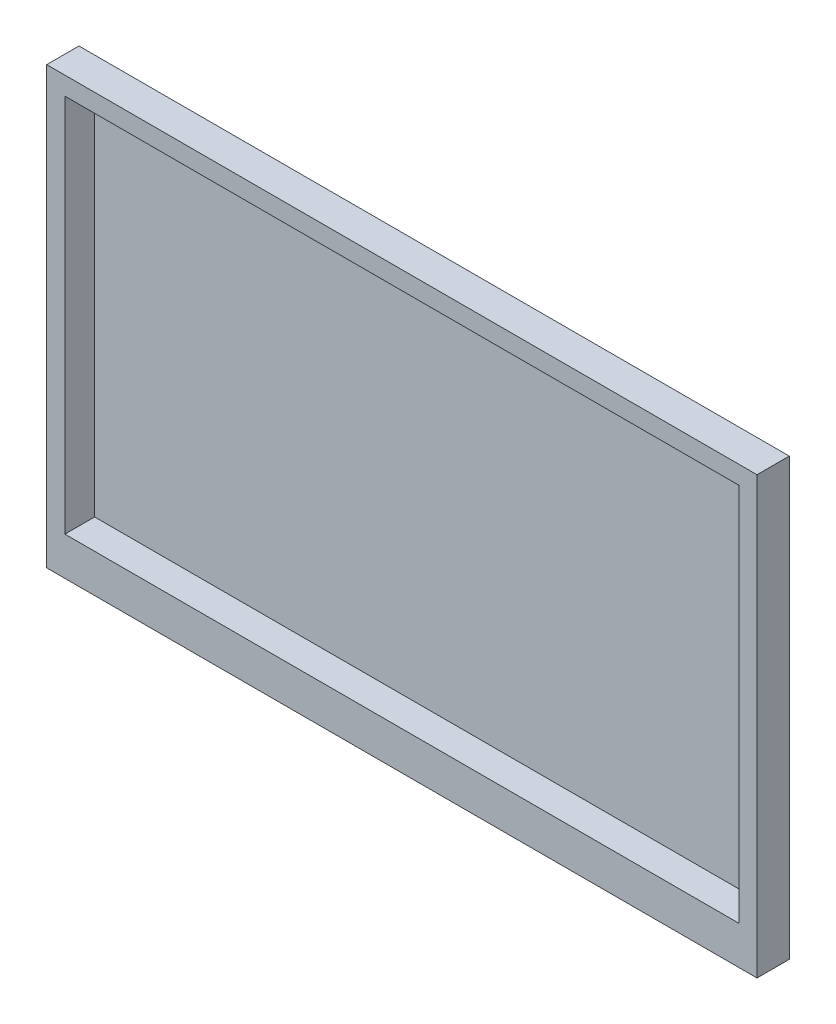
ISO-10303-21;
HEADER;
FILE_DESCRIPTION(('STEP AP214'),'2;1');
FILE_NAME('part.step','',(''),(''),'','','');
FILE_SCHEMA(('AUTOMOTIVE_DESIGN { 1 0 10303 214 1 1 1 1 }'));
ENDSEC;
DATA;
#1=APPLICATION_CONTEXT('core data for automotive mechanical design processes');
#2=APPLICATION_PROTOCOL_DEFINITION('international standard','automotive_design',2000,#1);
#3=PRODUCT_CONTEXT('',#1,'mechanical');
#4=PRODUCT('Part','Part','',(#3));
#5=PRODUCT_RELATED_PRODUCT_CATEGORY('part','',(#4));
#6=PRODUCT_DEFINITION_FORMATION('','',#4);
#7=PRODUCT_DEFINITION_CONTEXT('part definition',#1,'design');
#8=PRODUCT_DEFINITION('design','',#6,#7);
#9=PRODUCT_DEFINITION_SHAPE('','',#8);
#10=(LENGTH_UNIT() NAMED_UNIT(*) SI_UNIT(.MILLI.,.METRE.));
#11=(NAMED_UNIT(*) PLANE_ANGLE_UNIT() SI_UNIT($,.RADIAN.));
#12=(NAMED_UNIT(*) SI_UNIT($,.STERADIAN.) SOLID_ANGLE_UNIT());
#13=UNCERTAINTY_MEASURE_WITH_UNIT(LENGTH_MEASURE(1.E-05),#10,'distance_accuracy_value','');
#14=(GEOMETRIC_REPRESENTATION_CONTEXT(3) GLOBAL_UNCERTAINTY_ASSIGNED_CONTEXT((#13)) GLOBAL_UNIT_ASSIGNED_CONTEXT((#10,
#11,#12)) REPRESENTATION_CONTEXT('',''));
#15=CARTESIAN_POINT('',(0.,0.,0.));
#16=DIRECTION('',(0.,0.,1.));
#17=DIRECTION('',(1.,0.,0.));
#18=AXIS2_PLACEMENT_3D('',#15,#16,#17);
#19=CARTESIAN_POINT('',(279.4,-171.45,-25.4));
#20=DIRECTION('',(1.,0.,0.));
#21=DIRECTION('',(0.,0.,-1.));
#22=AXIS2_PLACEMENT_3D('',#19,#20,#21);
#23=PLANE('',#22);
#24=DIRECTION('',(0.,1.,0.));
#25=VECTOR('',#24,1.);
#26=CARTESIAN_POINT('',(279.4,-171.45,0.));
#27=LINE('',#26,#25);
#28=CARTESIAN_POINT('',(279.4,-171.45,0.));
#29=VERTEX_POINT('',#28);
#30=CARTESIAN_POINT('',(279.4,171.45,0.));
#31=VERTEX_POINT('',#30);
#32=EDGE_CURVE('E175',#29,#31,#27,.T.);
#33=ORIENTED_EDGE('',*,*,#32,.F.);
#34=DIRECTION('',(0.,0.,1.));
#35=VECTOR('',#34,1.);
#36=CARTESIAN_POINT('',(279.4,-171.45,-25.4));
#37=LINE('',#36,#35);
#38=CARTESIAN_POINT('',(279.4,-171.45,-25.4));
#39=VERTEX_POINT('',#38);
#40=EDGE_CURVE('E11',#39,#29,#37,.T.);
#41=ORIENTED_EDGE('',*,*,#40,.F.);
#42=DIRECTION('',(0.,1.,0.));
#43=VECTOR('',#42,1.);
#44=CARTESIAN_POINT('',(279.4,-171.45,-25.4));
#45=LINE('',#44,#43);
#46=CARTESIAN_POINT('',(279.4,171.45,-25.4));
#47=VERTEX_POINT('',#46);
#48=EDGE_CURVE('E181',#39,#47,#45,.T.);
#49=ORIENTED_EDGE('',*,*,#48,.T.);
#50=DIRECTION('',(0.,0.,1.));
#51=VECTOR('',#50,1.);
#52=CARTESIAN_POINT('',(279.4,171.45,-25.4));
#53=LINE('',#52,#51);
#54=EDGE_CURVE('E37',#47,#31,#53,.T.);
#55=ORIENTED_EDGE('',*,*,#54,.T.);
#56=EDGE_LOOP('',(#33,#41,#49,#55));
#57=FACE_BOUND('',#56,.T.);
#58=ADVANCED_FACE('F34',(#57),#23,.T.);
#59=CARTESIAN_POINT('',(-279.4,-171.45,-25.4));
#60=DIRECTION('',(0.,-1.,0.));
#61=DIRECTION('',(0.,0.,-1.));
#62=AXIS2_PLACEMENT_3D('',#59,#60,#61);
#63=PLANE('',#62);
#64=DIRECTION('',(1.,0.,0.));
#65=VECTOR('',#64,1.);
#66=CARTESIAN_POINT('',(-279.4,-171.45,0.));
#67=LINE('',#66,#65);
#68=CARTESIAN_POINT('',(-279.4,-171.45,0.));
#69=VERTEX_POINT('',#68);
#70=EDGE_CURVE('E185',#69,#29,#67,.T.);
#71=ORIENTED_EDGE('',*,*,#70,.F.);
#72=DIRECTION('',(0.,0.,1.));
#73=VECTOR('',#72,1.);
#74=CARTESIAN_POINT('',(-279.4,-171.45,-25.4));
#75=LINE('',#74,#73);
#76=CARTESIAN_POINT('',(-279.4,-171.45,-25.4));
#77=VERTEX_POINT('',#76);
#78=EDGE_CURVE('E42',#77,#69,#75,.T.);
#79=ORIENTED_EDGE('',*,*,#78,.F.);
#80=DIRECTION('',(1.,0.,0.));
#81=VECTOR('',#80,1.);
#82=CARTESIAN_POINT('',(-279.4,-171.45,-25.4));
#83=LINE('',#82,#81);
#84=EDGE_CURVE('E191',#77,#39,#83,.T.);
#85=ORIENTED_EDGE('',*,*,#84,.T.);
#86=ORIENTED_EDGE('',*,*,#40,.T.);
#87=EDGE_LOOP('',(#71,#79,#85,#86));
#88=FACE_BOUND('',#87,.T.);
#89=ADVANCED_FACE('F217',(#88),#63,.T.);
#90=CARTESIAN_POINT('',(-279.4,-171.45,-25.4));
#91=DIRECTION('',(-1.,0.,0.));
#92=DIRECTION('',(0.,0.,1.));
#93=AXIS2_PLACEMENT_3D('',#90,#91,#92);
#94=PLANE('',#93);
#95=DIRECTION('',(0.,-1.,0.));
#96=VECTOR('',#95,1.);
#97=CARTESIAN_POINT('',(-279.4,-171.45,0.));
#98=LINE('',#97,#96);
#99=CARTESIAN_POINT('',(-279.4,171.45,0.));
#100=VERTEX_POINT('',#99);
#101=EDGE_CURVE('E199',#100,#69,#98,.T.);
#102=ORIENTED_EDGE('',*,*,#101,.F.);
#103=DIRECTION('',(0.,0.,1.));
#104=VECTOR('',#103,1.);
#105=CARTESIAN_POINT('',(-279.4,171.45,-25.4));
#106=LINE('',#105,#104);
#107=CARTESIAN_POINT('',(-279.4,171.45,-25.4));
#108=VERTEX_POINT('',#107);
#109=EDGE_CURVE('E204',#108,#100,#106,.T.);
#110=ORIENTED_EDGE('',*,*,#109,.F.);
#111=DIRECTION('',(0.,-1.,0.));
#112=VECTOR('',#111,1.);
#113=CARTESIAN_POINT('',(-279.4,-171.45,-25.4));
#114=LINE('',#113,#112);
#115=EDGE_CURVE('E188',#108,#77,#114,.T.);
#116=ORIENTED_EDGE('',*,*,#115,.T.);
#117=ORIENTED_EDGE('',*,*,#78,.T.);
#118=EDGE_LOOP('',(#102,#110,#116,#117));
#119=FACE_BOUND('',#118,.T.);
#120=ADVANCED_FACE('F223',(#119),#94,.T.);
#121=CARTESIAN_POINT('',(-279.4,171.45,-25.4));
#122=DIRECTION('',(0.,1.,0.));
#123=DIRECTION('',(0.,0.,1.));
#124=AXIS2_PLACEMENT_3D('',#121,#122,#123);
#125=PLANE('',#124);
#126=DIRECTION('',(-1.,0.,0.));
#127=VECTOR('',#126,1.);
#128=CARTESIAN_POINT('',(-279.4,171.45,0.));
#129=LINE('',#128,#127);
#130=EDGE_CURVE('E196',#31,#100,#129,.T.);
#131=ORIENTED_EDGE('',*,*,#130,.F.);
#132=ORIENTED_EDGE('',*,*,#54,.F.);
#133=DIRECTION('',(-1.,0.,0.));
#134=VECTOR('',#133,1.);
#135=CARTESIAN_POINT('',(-279.4,171.45,-25.4));
#136=LINE('',#135,#134);
#137=EDGE_CURVE('E184',#47,#108,#136,.T.);
#138=ORIENTED_EDGE('',*,*,#137,.T.);
#139=ORIENTED_EDGE('',*,*,#109,.T.);
#140=EDGE_LOOP('',(#131,#132,#138,#139));
#141=FACE_BOUND('',#140,.T.);
#142=ADVANCED_FACE('F212',(#141),#125,.T.);
#143=CARTESIAN_POINT('',(0.,0.,-25.4));
#144=DIRECTION('',(0.,0.,-1.));
#145=DIRECTION('',(-1.,0.,0.));
#146=AXIS2_PLACEMENT_3D('',#143,#144,#145);
#147=PLANE('',#146);
#148=DIRECTION('',(0.,1.,0.));
#149=VECTOR('',#148,1.);
#150=CARTESIAN_POINT('',(-50.,-50.,-25.4));
#151=LINE('',#150,#149);
#152=CARTESIAN_POINT('',(-50.,-50.,-25.4));
#153=VERTEX_POINT('',#152);
#154=CARTESIAN_POINT('',(-50.,50.,-25.4));
#155=VERTEX_POINT('',#154);
#156=EDGE_CURVE('E50',#153,#155,#151,.T.);
#157=ORIENTED_EDGE('',*,*,#156,.F.);
#158=DIRECTION('',(-1.,0.,0.));
#159=VECTOR('',#158,1.);
#160=CARTESIAN_POINT('',(50.,-50.,-25.4));
#161=LINE('',#160,#159);
#162=CARTESIAN_POINT('',(50.,-50.,-25.4));
#163=VERTEX_POINT('',#162);
#164=EDGE_CURVE('E54',#163,#153,#161,.T.);
#165=ORIENTED_EDGE('',*,*,#164,.F.);
#166=DIRECTION('',(0.,-1.,0.));
#167=VECTOR('',#166,1.);
#168=CARTESIAN_POINT('',(50.,-50.,-25.4));
#169=LINE('',#168,#167);
#170=CARTESIAN_POINT('',(50.,50.,-25.4));
#171=VERTEX_POINT('',#170);
#172=EDGE_CURVE('E368',#171,#163,#169,.T.);
#173=ORIENTED_EDGE('',*,*,#172,.F.);
#174=DIRECTION('',(1.,0.,0.));
#175=VECTOR('',#174,1.);
#176=CARTESIAN_POINT('',(50.,50.,-25.4));
#177=LINE('',#176,#175);
#178=EDGE_CURVE('E374',#155,#171,#177,.T.);
#179=ORIENTED_EDGE('',*,*,#178,.F.);
#180=EDGE_LOOP('',(#157,#165,#173,#179));
#181=FACE_BOUND('',#180,.T.);
#182=ORIENTED_EDGE('',*,*,#48,.F.);
#183=ORIENTED_EDGE('',*,*,#84,.F.);
#184=ORIENTED_EDGE('',*,*,#115,.F.);
#185=ORIENTED_EDGE('',*,*,#137,.F.);
#186=EDGE_LOOP('',(#182,#183,#184,#185));
#187=FACE_BOUND('',#186,.T.);
#188=ADVANCED_FACE('F220',(#181,#187),#147,.T.);
#189=CARTESIAN_POINT('',(0.,0.,0.));
#190=DIRECTION('',(0.,0.,-1.));
#191=DIRECTION('',(-1.,0.,0.));
#192=AXIS2_PLACEMENT_3D('',#189,#190,#191);
#193=PLANE('',#192);
#194=DIRECTION('',(-1.,0.,0.));
#195=VECTOR('',#194,1.);
#196=CARTESIAN_POINT('',(-265.1125,157.1625,0.));
#197=LINE('',#196,#195);
#198=CARTESIAN_POINT('',(265.1125,157.1625,0.));
#199=VERTEX_POINT('',#198);
#200=CARTESIAN_POINT('',(-265.1125,157.1625,0.));
#201=VERTEX_POINT('',#200);
#202=EDGE_CURVE('E163',#199,#201,#197,.T.);
#203=ORIENTED_EDGE('',*,*,#202,.F.);
#204=DIRECTION('',(0.,1.,0.));
#205=VECTOR('',#204,1.);
#206=CARTESIAN_POINT('',(265.1125,-141.2875,0.));
#207=LINE('',#206,#205);
#208=CARTESIAN_POINT('',(265.1125,-141.2875,0.));
#209=VERTEX_POINT('',#208);
#210=EDGE_CURVE('E160',#209,#199,#207,.T.);
#211=ORIENTED_EDGE('',*,*,#210,.F.);
#212=DIRECTION('',(1.,0.,0.));
#213=VECTOR('',#212,1.);
#214=CARTESIAN_POINT('',(-265.1125,-141.2875,0.));
#215=LINE('',#214,#213);
#216=CARTESIAN_POINT('',(-265.1125,-141.2875,0.));
#217=VERTEX_POINT('',#216);
#218=EDGE_CURVE('E169',#217,#209,#215,.T.);
#219=ORIENTED_EDGE('',*,*,#218,.F.);
#220=DIRECTION('',(0.,-1.,0.));
#221=VECTOR('',#220,1.);
#222=CARTESIAN_POINT('',(-265.1125,-141.2875,0.));
#223=LINE('',#222,#221);
#224=EDGE_CURVE('E166',#201,#217,#223,.T.);
#225=ORIENTED_EDGE('',*,*,#224,.F.);
#226=EDGE_LOOP('',(#203,#211,#219,#225));
#227=FACE_BOUND('',#226,.T.);
#228=ORIENTED_EDGE('',*,*,#32,.T.);
#229=ORIENTED_EDGE('',*,*,#130,.T.);
#230=ORIENTED_EDGE('',*,*,#101,.T.);
#231=ORIENTED_EDGE('',*,*,#70,.T.);
#232=EDGE_LOOP('',(#228,#229,#230,#231));
#233=FACE_BOUND('',#232,.T.);
#234=ADVANCED_FACE('F214',(#227,#233),#193,.F.);
#235=CARTESIAN_POINT('',(265.1125,-141.2875,-25.4));
#236=DIRECTION('',(1.,0.,0.));
#237=DIRECTION('',(0.,0.,-1.));
#238=AXIS2_PLACEMENT_3D('',#235,#236,#237);
#239=PLANE('',#238);
#240=DIRECTION('',(0.,0.,1.));
#241=VECTOR('',#240,1.);
#242=CARTESIAN_POINT('',(265.1125,157.1625,-25.4));
#243=LINE('',#242,#241);
#244=CARTESIAN_POINT('',(265.1125,157.1625,-23.4));
#245=VERTEX_POINT('',#244);
#246=EDGE_CURVE('E172',#245,#199,#243,.T.);
#247=ORIENTED_EDGE('',*,*,#246,.F.);
#248=DIRECTION('',(0.,-1.,0.));
#249=VECTOR('',#248,1.);
#250=CARTESIAN_POINT('',(265.1125,-141.2875,-23.4));
#251=LINE('',#250,#249);
#252=CARTESIAN_POINT('',(265.1125,-141.2875,-23.4));
#253=VERTEX_POINT('',#252);
#254=EDGE_CURVE('E154',#245,#253,#251,.T.);
#255=ORIENTED_EDGE('',*,*,#254,.T.);
#256=DIRECTION('',(0.,0.,1.));
#257=VECTOR('',#256,1.);
#258=CARTESIAN_POINT('',(265.1125,-141.2875,-25.4));
#259=LINE('',#258,#257);
#260=EDGE_CURVE('E173',#253,#209,#259,.T.);
#261=ORIENTED_EDGE('',*,*,#260,.T.);
#262=ORIENTED_EDGE('',*,*,#210,.T.);
#263=EDGE_LOOP('',(#247,#255,#261,#262));
#264=FACE_BOUND('',#263,.T.);
#265=ADVANCED_FACE('F259',(#264),#239,.F.);
#266=CARTESIAN_POINT('',(-265.1125,-141.2875,-25.4));
#267=DIRECTION('',(0.,-1.,0.));
#268=DIRECTION('',(0.,0.,-1.));
#269=AXIS2_PLACEMENT_3D('',#266,#267,#268);
#270=PLANE('',#269);
#271=ORIENTED_EDGE('',*,*,#260,.F.);
#272=DIRECTION('',(-1.,0.,0.));
#273=VECTOR('',#272,1.);
#274=CARTESIAN_POINT('',(-265.1125,-141.2875,-23.4));
#275=LINE('',#274,#273);
#276=CARTESIAN_POINT('',(-265.1125,-141.2875,-23.4));
#277=VERTEX_POINT('',#276);
#278=EDGE_CURVE('E157',#253,#277,#275,.T.);
#279=ORIENTED_EDGE('',*,*,#278,.T.);
#280=DIRECTION('',(0.,0.,1.));
#281=VECTOR('',#280,1.);
#282=CARTESIAN_POINT('',(-265.1125,-141.2875,-25.4));
#283=LINE('',#282,#281);
#284=EDGE_CURVE('E176',#277,#217,#283,.T.);
#285=ORIENTED_EDGE('',*,*,#284,.T.);
#286=ORIENTED_EDGE('',*,*,#218,.T.);
#287=EDGE_LOOP('',(#271,#279,#285,#286));
#288=FACE_BOUND('',#287,.T.);
#289=ADVANCED_FACE('F269',(#288),#270,.F.);
#290=CARTESIAN_POINT('',(-265.1125,-141.2875,-25.4));
#291=DIRECTION('',(-1.,0.,0.));
#292=DIRECTION('',(0.,0.,1.));
#293=AXIS2_PLACEMENT_3D('',#290,#291,#292);
#294=PLANE('',#293);
#295=ORIENTED_EDGE('',*,*,#284,.F.);
#296=DIRECTION('',(0.,1.,0.));
#297=VECTOR('',#296,1.);
#298=CARTESIAN_POINT('',(-265.1125,157.1625,-23.4));
#299=LINE('',#298,#297);
#300=CARTESIAN_POINT('',(-265.1125,157.1625,-23.4));
#301=VERTEX_POINT('',#300);
#302=EDGE_CURVE('E143',#277,#301,#299,.T.);
#303=ORIENTED_EDGE('',*,*,#302,.T.);
#304=DIRECTION('',(0.,0.,1.));
#305=VECTOR('',#304,1.);
#306=CARTESIAN_POINT('',(-265.1125,157.1625,-25.4));
#307=LINE('',#306,#305);
#308=EDGE_CURVE('E178',#301,#201,#307,.T.);
#309=ORIENTED_EDGE('',*,*,#308,.T.);
#310=ORIENTED_EDGE('',*,*,#224,.T.);
#311=EDGE_LOOP('',(#295,#303,#309,#310));
#312=FACE_BOUND('',#311,.T.);
#313=ADVANCED_FACE('F279',(#312),#294,.F.);
#314=CARTESIAN_POINT('',(-265.1125,157.1625,-25.4));
#315=DIRECTION('',(0.,1.,0.));
#316=DIRECTION('',(0.,0.,1.));
#317=AXIS2_PLACEMENT_3D('',#314,#315,#316);
#318=PLANE('',#317);
#319=ORIENTED_EDGE('',*,*,#308,.F.);
#320=DIRECTION('',(1.,0.,0.));
#321=VECTOR('',#320,1.);
#322=CARTESIAN_POINT('',(265.1125,157.1625,-23.4));
#323=LINE('',#322,#321);
#324=EDGE_CURVE('E146',#301,#245,#323,.T.);
#325=ORIENTED_EDGE('',*,*,#324,.T.);
#326=ORIENTED_EDGE('',*,*,#246,.T.);
#327=ORIENTED_EDGE('',*,*,#202,.T.);
#328=EDGE_LOOP('',(#319,#325,#326,#327));
#329=FACE_BOUND('',#328,.T.);
#330=ADVANCED_FACE('F289',(#329),#318,.F.);
#331=CARTESIAN_POINT('',(0.,0.,-23.4));
#332=DIRECTION('',(0.,0.,1.));
#333=DIRECTION('',(1.,0.,0.));
#334=AXIS2_PLACEMENT_3D('',#331,#332,#333);
#335=PLANE('',#334);
#336=ORIENTED_EDGE('',*,*,#302,.F.);
#337=ORIENTED_EDGE('',*,*,#278,.F.);
#338=ORIENTED_EDGE('',*,*,#254,.F.);
#339=ORIENTED_EDGE('',*,*,#324,.F.);
#340=EDGE_LOOP('',(#336,#337,#338,#339));
#341=FACE_BOUND('',#340,.T.);
#342=ADVANCED_FACE('F299',(#341),#335,.T.);
#343=CARTESIAN_POINT('',(-50.,-50.,-101.6));
#344=DIRECTION('',(1.,0.,0.));
#345=DIRECTION('',(0.,0.,-1.));
#346=AXIS2_PLACEMENT_3D('',#343,#344,#345);
#347=PLANE('',#346);
#348=ORIENTED_EDGE('',*,*,#156,.T.);
#349=DIRECTION('',(0.,0.,1.));
#350=VECTOR('',#349,1.);
#351=CARTESIAN_POINT('',(-50.,50.,-101.6));
#352=LINE('',#351,#350);
#353=CARTESIAN_POINT('',(-50.,50.,-101.6));
#354=VERTEX_POINT('',#353);
#355=EDGE_CURVE('E126',#354,#155,#352,.T.);
#356=ORIENTED_EDGE('',*,*,#355,.F.);
#357=DIRECTION('',(0.,1.,0.));
#358=VECTOR('',#357,1.);
#359=CARTESIAN_POINT('',(-50.,-50.,-101.6));
#360=LINE('',#359,#358);
#361=CARTESIAN_POINT('',(-50.,-50.,-101.6));
#362=VERTEX_POINT('',#361);
#363=EDGE_CURVE('E132',#362,#354,#360,.T.);
#364=ORIENTED_EDGE('',*,*,#363,.F.);
#365=DIRECTION('',(0.,0.,1.));
#366=VECTOR('',#365,1.);
#367=CARTESIAN_POINT('',(-50.,-50.,-101.6));
#368=LINE('',#367,#366);
#369=EDGE_CURVE('E366',#362,#153,#368,.T.);
#370=ORIENTED_EDGE('',*,*,#369,.T.);
#371=EDGE_LOOP('',(#348,#356,#364,#370));
#372=FACE_BOUND('',#371,.T.);
#373=ADVANCED_FACE('F142',(#372),#347,.F.);
#374=CARTESIAN_POINT('',(50.,50.,-101.6));
#375=DIRECTION('',(0.,-1.,0.));
#376=DIRECTION('',(0.,0.,-1.));
#377=AXIS2_PLACEMENT_3D('',#374,#375,#376);
#378=PLANE('',#377);
#379=ORIENTED_EDGE('',*,*,#178,.T.);
#380=DIRECTION('',(0.,0.,1.));
#381=VECTOR('',#380,1.);
#382=CARTESIAN_POINT('',(50.,50.,-101.6));
#383=LINE('',#382,#381);
#384=CARTESIAN_POINT('',(50.,50.,-101.6));
#385=VERTEX_POINT('',#384);
#386=EDGE_CURVE('E128',#385,#171,#383,.T.);
#387=ORIENTED_EDGE('',*,*,#386,.F.);
#388=DIRECTION('',(1.,0.,0.));
#389=VECTOR('',#388,1.);
#390=CARTESIAN_POINT('',(50.,50.,-101.6));
#391=LINE('',#390,#389);
#392=EDGE_CURVE('E121',#354,#385,#391,.T.);
#393=ORIENTED_EDGE('',*,*,#392,.F.);
#394=ORIENTED_EDGE('',*,*,#355,.T.);
#395=EDGE_LOOP('',(#379,#387,#393,#394));
#396=FACE_BOUND('',#395,.T.);
#397=ADVANCED_FACE('F124',(#396),#378,.F.);
#398=CARTESIAN_POINT('',(50.,-50.,-101.6));
#399=DIRECTION('',(-1.,0.,0.));
#400=DIRECTION('',(0.,0.,1.));
#401=AXIS2_PLACEMENT_3D('',#398,#399,#400);
#402=PLANE('',#401);
#403=ORIENTED_EDGE('',*,*,#172,.T.);
#404=DIRECTION('',(0.,0.,1.));
#405=VECTOR('',#404,1.);
#406=CARTESIAN_POINT('',(50.,-50.,-101.6));
#407=LINE('',#406,#405);
#408=CARTESIAN_POINT('',(50.,-50.,-101.6));
#409=VERTEX_POINT('',#408);
#410=EDGE_CURVE('E148',#409,#163,#407,.T.);
#411=ORIENTED_EDGE('',*,*,#410,.F.);
#412=DIRECTION('',(0.,-1.,0.));
#413=VECTOR('',#412,1.);
#414=CARTESIAN_POINT('',(50.,-50.,-101.6));
#415=LINE('',#414,#413);
#416=EDGE_CURVE('E131',#385,#409,#415,.T.);
#417=ORIENTED_EDGE('',*,*,#416,.F.);
#418=ORIENTED_EDGE('',*,*,#386,.T.);
#419=EDGE_LOOP('',(#403,#411,#417,#418));
#420=FACE_BOUND('',#419,.T.);
#421=ADVANCED_FACE('F334',(#420),#402,.F.);
#422=CARTESIAN_POINT('',(50.,-50.,-101.6));
#423=DIRECTION('',(0.,1.,0.));
#424=DIRECTION('',(0.,0.,1.));
#425=AXIS2_PLACEMENT_3D('',#422,#423,#424);
#426=PLANE('',#425);
#427=ORIENTED_EDGE('',*,*,#164,.T.);
#428=ORIENTED_EDGE('',*,*,#369,.F.);
#429=DIRECTION('',(-1.,0.,0.));
#430=VECTOR('',#429,1.);
#431=CARTESIAN_POINT('',(50.,-50.,-101.6));
#432=LINE('',#431,#430);
#433=EDGE_CURVE('E137',#409,#362,#432,.T.);
#434=ORIENTED_EDGE('',*,*,#433,.F.);
#435=ORIENTED_EDGE('',*,*,#410,.T.);
#436=EDGE_LOOP('',(#427,#428,#434,#435));
#437=FACE_BOUND('',#436,.T.);
#438=ADVANCED_FACE('F343',(#437),#426,.F.);
#439=CARTESIAN_POINT('',(0.,0.,-101.6));
#440=DIRECTION('',(0.,0.,1.));
#441=DIRECTION('',(1.,0.,0.));
#442=AXIS2_PLACEMENT_3D('',#439,#440,#441);
#443=PLANE('',#442);
#444=ORIENTED_EDGE('',*,*,#363,.T.);
#445=ORIENTED_EDGE('',*,*,#392,.T.);
#446=ORIENTED_EDGE('',*,*,#416,.T.);
#447=ORIENTED_EDGE('',*,*,#433,.T.);
#448=EDGE_LOOP('',(#444,#445,#446,#447));
#449=FACE_BOUND('',#448,.T.);
#450=ADVANCED_FACE('F135',(#449),#443,.F.);
#451=CLOSED_SHELL('',(#58,#89,#120,#142,#188,#234,#265,#289,#313,#330,#342,#373,#397,#421,#438,#450));
#452=MANIFOLD_SOLID_BREP('B2',#451);
#453=ADVANCED_BREP_SHAPE_REPRESENTATION('',(#18,#452),#14);
#454=SHAPE_DEFINITION_REPRESENTATION(#9,#453);
ENDSEC;
END-ISO-10303-21;
